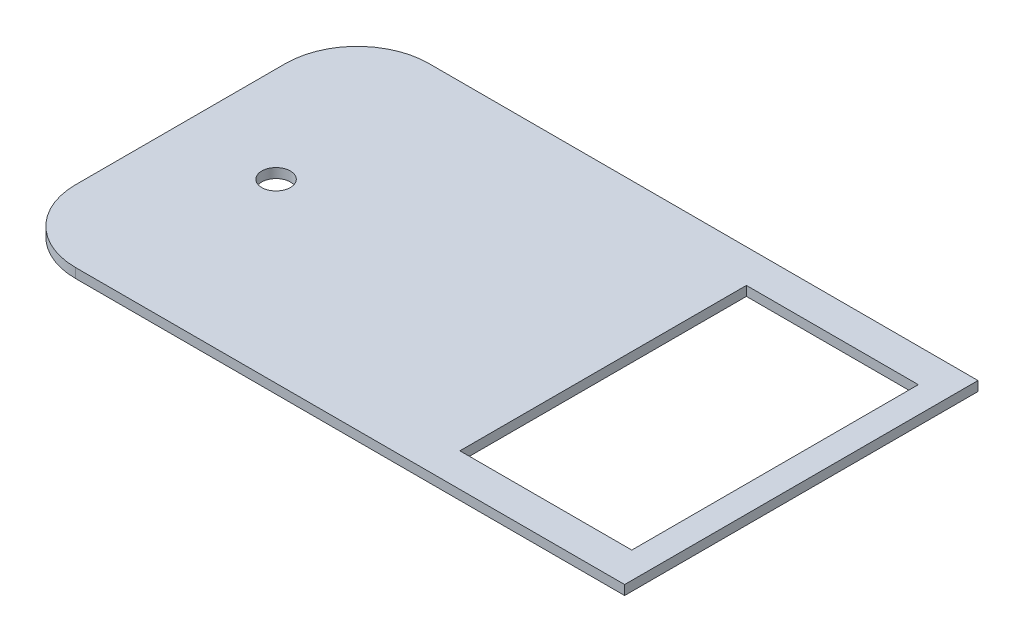
ISO-10303-21;
HEADER;
FILE_DESCRIPTION(('STEP AP214'),'2;1');
FILE_NAME('part.step','',(''),(''),'','','');
FILE_SCHEMA(('AUTOMOTIVE_DESIGN { 1 0 10303 214 1 1 1 1 }'));
ENDSEC;
DATA;
#1=APPLICATION_CONTEXT('core data for automotive mechanical design processes');
#2=APPLICATION_PROTOCOL_DEFINITION('international standard','automotive_design',2000,#1);
#3=PRODUCT_CONTEXT('',#1,'mechanical');
#4=PRODUCT('Part','Part','',(#3));
#5=PRODUCT_RELATED_PRODUCT_CATEGORY('part','',(#4));
#6=PRODUCT_DEFINITION_FORMATION('','',#4);
#7=PRODUCT_DEFINITION_CONTEXT('part definition',#1,'design');
#8=PRODUCT_DEFINITION('design','',#6,#7);
#9=PRODUCT_DEFINITION_SHAPE('','',#8);
#10=(LENGTH_UNIT() NAMED_UNIT(*) SI_UNIT(.MILLI.,.METRE.));
#11=(NAMED_UNIT(*) PLANE_ANGLE_UNIT() SI_UNIT($,.RADIAN.));
#12=(NAMED_UNIT(*) SI_UNIT($,.STERADIAN.) SOLID_ANGLE_UNIT());
#13=UNCERTAINTY_MEASURE_WITH_UNIT(LENGTH_MEASURE(1.E-05),#10,'distance_accuracy_value','');
#14=(GEOMETRIC_REPRESENTATION_CONTEXT(3) GLOBAL_UNCERTAINTY_ASSIGNED_CONTEXT((#13)) GLOBAL_UNIT_ASSIGNED_CONTEXT((#10,
#11,#12)) REPRESENTATION_CONTEXT('',''));
#15=CARTESIAN_POINT('',(0.,0.,0.));
#16=DIRECTION('',(0.,0.,1.));
#17=DIRECTION('',(1.,0.,0.));
#18=AXIS2_PLACEMENT_3D('',#15,#16,#17);
#19=CARTESIAN_POINT('',(0.,261.,0.));
#20=DIRECTION('',(0.,-1.,0.));
#21=DIRECTION('',(0.,0.,-1.));
#22=AXIS2_PLACEMENT_3D('',#19,#20,#21);
#23=PLANE('',#22);
#24=CARTESIAN_POINT('',(-106.5,261.,0.));
#25=DIRECTION('',(0.,-1.,0.));
#26=DIRECTION('',(0.,0.,-1.));
#27=AXIS2_PLACEMENT_3D('',#24,#25,#26);
#28=CIRCLE('',#27,3.00000000000001);
#29=CARTESIAN_POINT('',(-106.5,261.,-3.00000000000001));
#30=VERTEX_POINT('',#29);
#31=EDGE_CURVE('E352',#30,#30,#28,.T.);
#32=ORIENTED_EDGE('',*,*,#31,.T.);
#33=EDGE_LOOP('',(#32));
#34=FACE_BOUND('',#33,.T.);
#35=DIRECTION('',(0.,0.,1.));
#36=VECTOR('',#35,1.);
#37=CARTESIAN_POINT('',(-126.5,261.,-37.));
#38=LINE('',#37,#36);
#39=CARTESIAN_POINT('',(-126.5,261.,-22.));
#40=VERTEX_POINT('',#39);
#41=CARTESIAN_POINT('',(-126.5,261.,22.));
#42=VERTEX_POINT('',#41);
#43=EDGE_CURVE('E164',#40,#42,#38,.T.);
#44=ORIENTED_EDGE('',*,*,#43,.T.);
#45=CARTESIAN_POINT('',(-111.5,261.,22.));
#46=DIRECTION('',(0.,-1.,0.));
#47=DIRECTION('',(0.,0.,-1.));
#48=AXIS2_PLACEMENT_3D('',#45,#46,#47);
#49=CIRCLE('',#48,15.);
#50=CARTESIAN_POINT('',(-111.5,261.,37.));
#51=VERTEX_POINT('',#50);
#52=EDGE_CURVE('E44',#42,#51,#49,.F.);
#53=ORIENTED_EDGE('',*,*,#52,.T.);
#54=DIRECTION('',(1.,0.,0.));
#55=VECTOR('',#54,1.);
#56=CARTESIAN_POINT('',(3.49999999999999,261.,37.));
#57=LINE('',#56,#55);
#58=CARTESIAN_POINT('',(3.49999999999999,261.,37.));
#59=VERTEX_POINT('',#58);
#60=EDGE_CURVE('E166',#51,#59,#57,.T.);
#61=ORIENTED_EDGE('',*,*,#60,.T.);
#62=DIRECTION('',(0.,0.,-1.));
#63=VECTOR('',#62,1.);
#64=CARTESIAN_POINT('',(3.50000000000001,261.,-37.));
#65=LINE('',#64,#63);
#66=CARTESIAN_POINT('',(3.50000000000001,261.,-37.));
#67=VERTEX_POINT('',#66);
#68=EDGE_CURVE('E158',#59,#67,#65,.T.);
#69=ORIENTED_EDGE('',*,*,#68,.T.);
#70=DIRECTION('',(-1.,0.,0.));
#71=VECTOR('',#70,1.);
#72=CARTESIAN_POINT('',(3.50000000000001,261.,-37.));
#73=LINE('',#72,#71);
#74=CARTESIAN_POINT('',(-111.5,261.,-37.));
#75=VERTEX_POINT('',#74);
#76=EDGE_CURVE('E161',#67,#75,#73,.T.);
#77=ORIENTED_EDGE('',*,*,#76,.T.);
#78=CARTESIAN_POINT('',(-111.5,261.,-22.));
#79=DIRECTION('',(0.,-1.,0.));
#80=DIRECTION('',(0.,0.,-1.));
#81=AXIS2_PLACEMENT_3D('',#78,#79,#80);
#82=CIRCLE('',#81,15.);
#83=EDGE_CURVE('E192',#75,#40,#82,.F.);
#84=ORIENTED_EDGE('',*,*,#83,.T.);
#85=EDGE_LOOP('',(#44,#53,#61,#69,#77,#84));
#86=FACE_BOUND('',#85,.T.);
#87=DIRECTION('',(0.,0.,1.));
#88=VECTOR('',#87,1.);
#89=CARTESIAN_POINT('',(-38.,261.,30.));
#90=LINE('',#89,#88);
#91=CARTESIAN_POINT('',(-38.,261.,-30.));
#92=VERTEX_POINT('',#91);
#93=CARTESIAN_POINT('',(-38.,261.,30.));
#94=VERTEX_POINT('',#93);
#95=EDGE_CURVE('E115',#92,#94,#90,.T.);
#96=ORIENTED_EDGE('',*,*,#95,.F.);
#97=DIRECTION('',(-1.,0.,0.));
#98=VECTOR('',#97,1.);
#99=CARTESIAN_POINT('',(-1.99999999999999,261.,-30.));
#100=LINE('',#99,#98);
#101=CARTESIAN_POINT('',(-1.99999999999999,261.,-30.));
#102=VERTEX_POINT('',#101);
#103=EDGE_CURVE('E140',#102,#92,#100,.T.);
#104=ORIENTED_EDGE('',*,*,#103,.F.);
#105=DIRECTION('',(0.,0.,-1.));
#106=VECTOR('',#105,1.);
#107=CARTESIAN_POINT('',(-2.00000000000001,261.,30.));
#108=LINE('',#107,#106);
#109=CARTESIAN_POINT('',(-2.00000000000001,261.,30.));
#110=VERTEX_POINT('',#109);
#111=EDGE_CURVE('E138',#110,#102,#108,.T.);
#112=ORIENTED_EDGE('',*,*,#111,.F.);
#113=DIRECTION('',(1.,0.,0.));
#114=VECTOR('',#113,1.);
#115=CARTESIAN_POINT('',(-2.00000000000001,261.,30.));
#116=LINE('',#115,#114);
#117=EDGE_CURVE('E125',#94,#110,#116,.T.);
#118=ORIENTED_EDGE('',*,*,#117,.F.);
#119=EDGE_LOOP('',(#96,#104,#112,#118));
#120=FACE_BOUND('',#119,.T.);
#121=ADVANCED_FACE('F36',(#34,#86,#120),#23,.F.);
#122=CARTESIAN_POINT('',(0.,259.,0.));
#123=DIRECTION('',(0.,-1.,0.));
#124=DIRECTION('',(0.,0.,-1.));
#125=AXIS2_PLACEMENT_3D('',#122,#123,#124);
#126=PLANE('',#125);
#127=CARTESIAN_POINT('',(-106.5,259.,0.));
#128=DIRECTION('',(0.,1.,0.));
#129=DIRECTION('',(0.,0.,1.));
#130=AXIS2_PLACEMENT_3D('',#127,#128,#129);
#131=CIRCLE('',#130,3.00000000000001);
#132=CARTESIAN_POINT('',(-106.5,259.,3.00000000000001));
#133=VERTEX_POINT('',#132);
#134=EDGE_CURVE('E147',#133,#133,#131,.T.);
#135=ORIENTED_EDGE('',*,*,#134,.T.);
#136=EDGE_LOOP('',(#135));
#137=FACE_BOUND('',#136,.T.);
#138=DIRECTION('',(1.,0.,0.));
#139=VECTOR('',#138,1.);
#140=CARTESIAN_POINT('',(3.49999999999999,259.,37.));
#141=LINE('',#140,#139);
#142=CARTESIAN_POINT('',(-111.5,259.,37.));
#143=VERTEX_POINT('',#142);
#144=CARTESIAN_POINT('',(3.49999999999999,259.,37.));
#145=VERTEX_POINT('',#144);
#146=EDGE_CURVE('E162',#143,#145,#141,.T.);
#147=ORIENTED_EDGE('',*,*,#146,.F.);
#148=CARTESIAN_POINT('',(-111.5,259.,22.));
#149=DIRECTION('',(0.,-1.,0.));
#150=DIRECTION('',(0.,0.,-1.));
#151=AXIS2_PLACEMENT_3D('',#148,#149,#150);
#152=CIRCLE('',#151,15.);
#153=CARTESIAN_POINT('',(-126.5,259.,22.));
#154=VERTEX_POINT('',#153);
#155=EDGE_CURVE('E186',#143,#154,#152,.T.);
#156=ORIENTED_EDGE('',*,*,#155,.T.);
#157=DIRECTION('',(0.,0.,1.));
#158=VECTOR('',#157,1.);
#159=CARTESIAN_POINT('',(-126.5,259.,-37.));
#160=LINE('',#159,#158);
#161=CARTESIAN_POINT('',(-126.5,259.,-22.));
#162=VERTEX_POINT('',#161);
#163=EDGE_CURVE('E173',#162,#154,#160,.T.);
#164=ORIENTED_EDGE('',*,*,#163,.F.);
#165=CARTESIAN_POINT('',(-111.5,259.,-22.));
#166=DIRECTION('',(0.,-1.,0.));
#167=DIRECTION('',(0.,0.,-1.));
#168=AXIS2_PLACEMENT_3D('',#165,#166,#167);
#169=CIRCLE('',#168,15.);
#170=CARTESIAN_POINT('',(-111.5,259.,-37.));
#171=VERTEX_POINT('',#170);
#172=EDGE_CURVE('E184',#162,#171,#169,.T.);
#173=ORIENTED_EDGE('',*,*,#172,.T.);
#174=DIRECTION('',(-1.,0.,0.));
#175=VECTOR('',#174,1.);
#176=CARTESIAN_POINT('',(3.50000000000001,259.,-37.));
#177=LINE('',#176,#175);
#178=CARTESIAN_POINT('',(3.50000000000001,259.,-37.));
#179=VERTEX_POINT('',#178);
#180=EDGE_CURVE('E171',#179,#171,#177,.T.);
#181=ORIENTED_EDGE('',*,*,#180,.F.);
#182=DIRECTION('',(0.,0.,-1.));
#183=VECTOR('',#182,1.);
#184=CARTESIAN_POINT('',(3.50000000000001,259.,-37.));
#185=LINE('',#184,#183);
#186=EDGE_CURVE('E133',#145,#179,#185,.T.);
#187=ORIENTED_EDGE('',*,*,#186,.F.);
#188=EDGE_LOOP('',(#147,#156,#164,#173,#181,#187));
#189=FACE_BOUND('',#188,.T.);
#190=DIRECTION('',(-1.,0.,0.));
#191=VECTOR('',#190,1.);
#192=CARTESIAN_POINT('',(-1.99999999999999,259.,-30.));
#193=LINE('',#192,#191);
#194=CARTESIAN_POINT('',(-1.99999999999999,259.,-30.));
#195=VERTEX_POINT('',#194);
#196=CARTESIAN_POINT('',(-38.,259.,-30.));
#197=VERTEX_POINT('',#196);
#198=EDGE_CURVE('E126',#195,#197,#193,.T.);
#199=ORIENTED_EDGE('',*,*,#198,.T.);
#200=DIRECTION('',(0.,0.,1.));
#201=VECTOR('',#200,1.);
#202=CARTESIAN_POINT('',(-38.,259.,30.));
#203=LINE('',#202,#201);
#204=CARTESIAN_POINT('',(-38.,259.,30.));
#205=VERTEX_POINT('',#204);
#206=EDGE_CURVE('E145',#197,#205,#203,.T.);
#207=ORIENTED_EDGE('',*,*,#206,.T.);
#208=DIRECTION('',(1.,0.,0.));
#209=VECTOR('',#208,1.);
#210=CARTESIAN_POINT('',(-2.00000000000001,259.,30.));
#211=LINE('',#210,#209);
#212=CARTESIAN_POINT('',(-2.00000000000001,259.,30.));
#213=VERTEX_POINT('',#212);
#214=EDGE_CURVE('E132',#205,#213,#211,.T.);
#215=ORIENTED_EDGE('',*,*,#214,.T.);
#216=DIRECTION('',(0.,0.,-1.));
#217=VECTOR('',#216,1.);
#218=CARTESIAN_POINT('',(-2.00000000000001,259.,30.));
#219=LINE('',#218,#217);
#220=EDGE_CURVE('E149',#213,#195,#219,.T.);
#221=ORIENTED_EDGE('',*,*,#220,.T.);
#222=EDGE_LOOP('',(#199,#207,#215,#221));
#223=FACE_BOUND('',#222,.T.);
#224=ADVANCED_FACE('F206',(#137,#189,#223),#126,.T.);
#225=CARTESIAN_POINT('',(3.50000000000001,261.,-37.));
#226=DIRECTION('',(-1.,0.,0.));
#227=DIRECTION('',(0.,0.,1.));
#228=AXIS2_PLACEMENT_3D('',#225,#226,#227);
#229=PLANE('',#228);
#230=ORIENTED_EDGE('',*,*,#186,.T.);
#231=DIRECTION('',(0.,-1.,0.));
#232=VECTOR('',#231,1.);
#233=CARTESIAN_POINT('',(3.50000000000001,261.,-37.));
#234=LINE('',#233,#232);
#235=EDGE_CURVE('E178',#67,#179,#234,.T.);
#236=ORIENTED_EDGE('',*,*,#235,.F.);
#237=ORIENTED_EDGE('',*,*,#68,.F.);
#238=DIRECTION('',(0.,-1.,0.));
#239=VECTOR('',#238,1.);
#240=CARTESIAN_POINT('',(3.49999999999999,261.,37.));
#241=LINE('',#240,#239);
#242=EDGE_CURVE('E168',#59,#145,#241,.T.);
#243=ORIENTED_EDGE('',*,*,#242,.T.);
#244=EDGE_LOOP('',(#230,#236,#237,#243));
#245=FACE_BOUND('',#244,.T.);
#246=ADVANCED_FACE('F216',(#245),#229,.F.);
#247=CARTESIAN_POINT('',(3.50000000000001,261.,-37.));
#248=DIRECTION('',(0.,0.,1.));
#249=DIRECTION('',(1.,0.,0.));
#250=AXIS2_PLACEMENT_3D('',#247,#248,#249);
#251=PLANE('',#250);
#252=ORIENTED_EDGE('',*,*,#180,.T.);
#253=DIRECTION('',(0.,-1.,0.));
#254=VECTOR('',#253,1.);
#255=CARTESIAN_POINT('',(-111.5,261.,-37.));
#256=LINE('',#255,#254);
#257=EDGE_CURVE('E11',#171,#75,#256,.F.);
#258=ORIENTED_EDGE('',*,*,#257,.T.);
#259=ORIENTED_EDGE('',*,*,#76,.F.);
#260=ORIENTED_EDGE('',*,*,#235,.T.);
#261=EDGE_LOOP('',(#252,#258,#259,#260));
#262=FACE_BOUND('',#261,.T.);
#263=ADVANCED_FACE('F213',(#262),#251,.F.);
#264=CARTESIAN_POINT('',(-126.5,261.,-37.));
#265=DIRECTION('',(1.,0.,0.));
#266=DIRECTION('',(0.,0.,-1.));
#267=AXIS2_PLACEMENT_3D('',#264,#265,#266);
#268=PLANE('',#267);
#269=ORIENTED_EDGE('',*,*,#163,.T.);
#270=DIRECTION('',(0.,-1.,0.));
#271=VECTOR('',#270,1.);
#272=CARTESIAN_POINT('',(-126.5,261.,22.));
#273=LINE('',#272,#271);
#274=EDGE_CURVE('E57',#154,#42,#273,.F.);
#275=ORIENTED_EDGE('',*,*,#274,.T.);
#276=ORIENTED_EDGE('',*,*,#43,.F.);
#277=DIRECTION('',(0.,-1.,0.));
#278=VECTOR('',#277,1.);
#279=CARTESIAN_POINT('',(-126.5,261.,-22.));
#280=LINE('',#279,#278);
#281=EDGE_CURVE('E188',#40,#162,#280,.T.);
#282=ORIENTED_EDGE('',*,*,#281,.T.);
#283=EDGE_LOOP('',(#269,#275,#276,#282));
#284=FACE_BOUND('',#283,.T.);
#285=ADVANCED_FACE('F209',(#284),#268,.F.);
#286=CARTESIAN_POINT('',(3.49999999999999,261.,37.));
#287=DIRECTION('',(0.,0.,-1.));
#288=DIRECTION('',(-1.,0.,0.));
#289=AXIS2_PLACEMENT_3D('',#286,#287,#288);
#290=PLANE('',#289);
#291=ORIENTED_EDGE('',*,*,#60,.F.);
#292=DIRECTION('',(0.,-1.,0.));
#293=VECTOR('',#292,1.);
#294=CARTESIAN_POINT('',(-111.5,261.,37.));
#295=LINE('',#294,#293);
#296=EDGE_CURVE('E181',#51,#143,#295,.T.);
#297=ORIENTED_EDGE('',*,*,#296,.T.);
#298=ORIENTED_EDGE('',*,*,#146,.T.);
#299=ORIENTED_EDGE('',*,*,#242,.F.);
#300=EDGE_LOOP('',(#291,#297,#298,#299));
#301=FACE_BOUND('',#300,.T.);
#302=ADVANCED_FACE('F200',(#301),#290,.F.);
#303=CARTESIAN_POINT('',(-38.,261.,30.));
#304=DIRECTION('',(1.,0.,0.));
#305=DIRECTION('',(0.,0.,-1.));
#306=AXIS2_PLACEMENT_3D('',#303,#304,#305);
#307=PLANE('',#306);
#308=ORIENTED_EDGE('',*,*,#206,.F.);
#309=DIRECTION('',(0.,-1.,0.));
#310=VECTOR('',#309,1.);
#311=CARTESIAN_POINT('',(-38.,261.,-30.));
#312=LINE('',#311,#310);
#313=EDGE_CURVE('E121',#92,#197,#312,.T.);
#314=ORIENTED_EDGE('',*,*,#313,.F.);
#315=ORIENTED_EDGE('',*,*,#95,.T.);
#316=DIRECTION('',(0.,-1.,0.));
#317=VECTOR('',#316,1.);
#318=CARTESIAN_POINT('',(-38.,261.,30.));
#319=LINE('',#318,#317);
#320=EDGE_CURVE('E118',#94,#205,#319,.T.);
#321=ORIENTED_EDGE('',*,*,#320,.T.);
#322=EDGE_LOOP('',(#308,#314,#315,#321));
#323=FACE_BOUND('',#322,.T.);
#324=ADVANCED_FACE('F117',(#323),#307,.T.);
#325=CARTESIAN_POINT('',(-2.00000000000001,261.,30.));
#326=DIRECTION('',(0.,0.,-1.));
#327=DIRECTION('',(-1.,0.,0.));
#328=AXIS2_PLACEMENT_3D('',#325,#326,#327);
#329=PLANE('',#328);
#330=ORIENTED_EDGE('',*,*,#214,.F.);
#331=ORIENTED_EDGE('',*,*,#320,.F.);
#332=ORIENTED_EDGE('',*,*,#117,.T.);
#333=DIRECTION('',(0.,-1.,0.));
#334=VECTOR('',#333,1.);
#335=CARTESIAN_POINT('',(-2.00000000000001,261.,30.));
#336=LINE('',#335,#334);
#337=EDGE_CURVE('E134',#110,#213,#336,.T.);
#338=ORIENTED_EDGE('',*,*,#337,.T.);
#339=EDGE_LOOP('',(#330,#331,#332,#338));
#340=FACE_BOUND('',#339,.T.);
#341=ADVANCED_FACE('F129',(#340),#329,.T.);
#342=CARTESIAN_POINT('',(-2.00000000000001,261.,30.));
#343=DIRECTION('',(-1.,0.,0.));
#344=DIRECTION('',(0.,0.,1.));
#345=AXIS2_PLACEMENT_3D('',#342,#343,#344);
#346=PLANE('',#345);
#347=ORIENTED_EDGE('',*,*,#220,.F.);
#348=ORIENTED_EDGE('',*,*,#337,.F.);
#349=ORIENTED_EDGE('',*,*,#111,.T.);
#350=DIRECTION('',(0.,-1.,0.));
#351=VECTOR('',#350,1.);
#352=CARTESIAN_POINT('',(-1.99999999999999,261.,-30.));
#353=LINE('',#352,#351);
#354=EDGE_CURVE('E155',#102,#195,#353,.T.);
#355=ORIENTED_EDGE('',*,*,#354,.T.);
#356=EDGE_LOOP('',(#347,#348,#349,#355));
#357=FACE_BOUND('',#356,.T.);
#358=ADVANCED_FACE('F260',(#357),#346,.T.);
#359=CARTESIAN_POINT('',(-1.99999999999999,261.,-30.));
#360=DIRECTION('',(0.,0.,1.));
#361=DIRECTION('',(1.,0.,0.));
#362=AXIS2_PLACEMENT_3D('',#359,#360,#361);
#363=PLANE('',#362);
#364=ORIENTED_EDGE('',*,*,#198,.F.);
#365=ORIENTED_EDGE('',*,*,#354,.F.);
#366=ORIENTED_EDGE('',*,*,#103,.T.);
#367=ORIENTED_EDGE('',*,*,#313,.T.);
#368=EDGE_LOOP('',(#364,#365,#366,#367));
#369=FACE_BOUND('',#368,.T.);
#370=ADVANCED_FACE('F267',(#369),#363,.T.);
#371=CARTESIAN_POINT('',(-106.5,261.001,0.));
#372=DIRECTION('',(0.,-1.,0.));
#373=DIRECTION('',(0.,0.,-1.));
#374=AXIS2_PLACEMENT_3D('',#371,#372,#373);
#375=CYLINDRICAL_SURFACE('',#374,3.00000000000001);
#376=ORIENTED_EDGE('',*,*,#134,.F.);
#377=EDGE_LOOP('',(#376));
#378=FACE_BOUND('',#377,.T.);
#379=ORIENTED_EDGE('',*,*,#31,.F.);
#380=EDGE_LOOP('',(#379));
#381=FACE_BOUND('',#380,.T.);
#382=ADVANCED_FACE('F276',(#378,#381),#375,.F.);
#383=CARTESIAN_POINT('',(-111.5,261.,22.));
#384=DIRECTION('',(0.,-1.,0.));
#385=DIRECTION('',(0.,0.,-1.));
#386=AXIS2_PLACEMENT_3D('',#383,#384,#385);
#387=CYLINDRICAL_SURFACE('',#386,15.);
#388=ORIENTED_EDGE('',*,*,#52,.F.);
#389=ORIENTED_EDGE('',*,*,#274,.F.);
#390=ORIENTED_EDGE('',*,*,#155,.F.);
#391=ORIENTED_EDGE('',*,*,#296,.F.);
#392=EDGE_LOOP('',(#388,#389,#390,#391));
#393=FACE_BOUND('',#392,.T.);
#394=ADVANCED_FACE('F203',(#393),#387,.T.);
#395=CARTESIAN_POINT('',(-111.5,261.,-22.));
#396=DIRECTION('',(0.,-1.,0.));
#397=DIRECTION('',(0.,0.,-1.));
#398=AXIS2_PLACEMENT_3D('',#395,#396,#397);
#399=CYLINDRICAL_SURFACE('',#398,15.);
#400=ORIENTED_EDGE('',*,*,#83,.F.);
#401=ORIENTED_EDGE('',*,*,#257,.F.);
#402=ORIENTED_EDGE('',*,*,#172,.F.);
#403=ORIENTED_EDGE('',*,*,#281,.F.);
#404=EDGE_LOOP('',(#400,#401,#402,#403));
#405=FACE_BOUND('',#404,.T.);
#406=ADVANCED_FACE('F38',(#405),#399,.T.);
#407=CLOSED_SHELL('',(#121,#224,#246,#263,#285,#302,#324,#341,#358,#370,#382,#394,#406));
#408=MANIFOLD_SOLID_BREP('B2',#407);
#409=ADVANCED_BREP_SHAPE_REPRESENTATION('',(#18,#408),#14);
#410=SHAPE_DEFINITION_REPRESENTATION(#9,#409);
ENDSEC;
END-ISO-10303-21;
